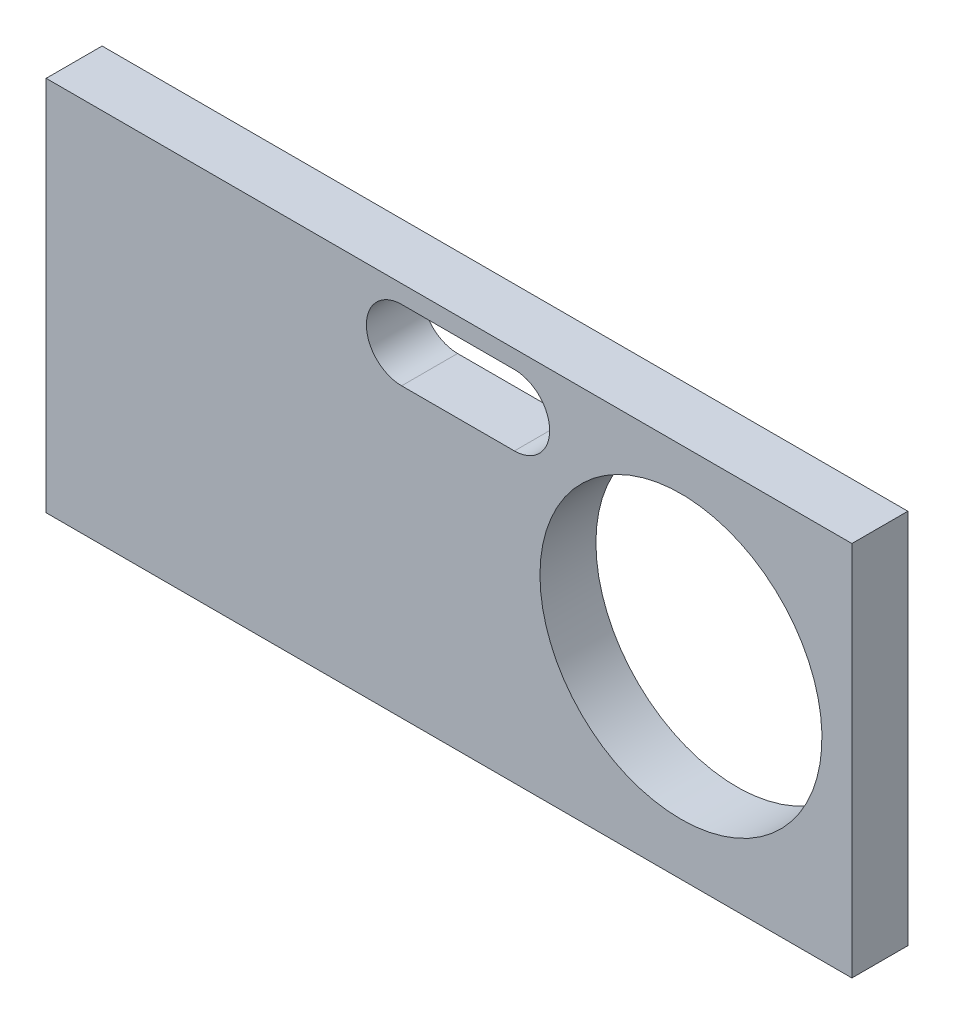
ISO-10303-21;
HEADER;
FILE_DESCRIPTION(('STEP AP214'),'2;1');
FILE_NAME('part.step','',(''),(''),'','','');
FILE_SCHEMA(('AUTOMOTIVE_DESIGN { 1 0 10303 214 1 1 1 1 }'));
ENDSEC;
DATA;
#1=APPLICATION_CONTEXT('core data for automotive mechanical design processes');
#2=APPLICATION_PROTOCOL_DEFINITION('international standard','automotive_design',2000,#1);
#3=PRODUCT_CONTEXT('',#1,'mechanical');
#4=PRODUCT('Part','Part','',(#3));
#5=PRODUCT_RELATED_PRODUCT_CATEGORY('part','',(#4));
#6=PRODUCT_DEFINITION_FORMATION('','',#4);
#7=PRODUCT_DEFINITION_CONTEXT('part definition',#1,'design');
#8=PRODUCT_DEFINITION('design','',#6,#7);
#9=PRODUCT_DEFINITION_SHAPE('','',#8);
#10=(LENGTH_UNIT() NAMED_UNIT(*) SI_UNIT(.MILLI.,.METRE.));
#11=(NAMED_UNIT(*) PLANE_ANGLE_UNIT() SI_UNIT($,.RADIAN.));
#12=(NAMED_UNIT(*) SI_UNIT($,.STERADIAN.) SOLID_ANGLE_UNIT());
#13=UNCERTAINTY_MEASURE_WITH_UNIT(LENGTH_MEASURE(1.E-05),#10,'distance_accuracy_value','');
#14=(GEOMETRIC_REPRESENTATION_CONTEXT(3) GLOBAL_UNCERTAINTY_ASSIGNED_CONTEXT((#13)) GLOBAL_UNIT_ASSIGNED_CONTEXT((#10,
#11,#12)) REPRESENTATION_CONTEXT('',''));
#15=CARTESIAN_POINT('',(0.,0.,0.));
#16=DIRECTION('',(0.,0.,1.));
#17=DIRECTION('',(1.,0.,0.));
#18=AXIS2_PLACEMENT_3D('',#15,#16,#17);
#19=CARTESIAN_POINT('',(22.86,3.175,10.16));
#20=DIRECTION('',(-1.,0.,0.));
#21=DIRECTION('',(0.,0.,1.));
#22=AXIS2_PLACEMENT_3D('',#19,#20,#21);
#23=PLANE('',#22);
#24=DIRECTION('',(0.,-1.,0.));
#25=VECTOR('',#24,1.);
#26=CARTESIAN_POINT('',(22.86,44.958,-6.985));
#27=LINE('',#26,#25);
#28=CARTESIAN_POINT('',(22.86,44.958,-6.985));
#29=VERTEX_POINT('',#28);
#30=CARTESIAN_POINT('',(22.86,23.6076153450278,-6.985));
#31=VERTEX_POINT('',#30);
#32=EDGE_CURVE('E112',#29,#31,#27,.T.);
#33=ORIENTED_EDGE('',*,*,#32,.T.);
#34=DIRECTION('',(0.,0.,1.));
#35=VECTOR('',#34,1.);
#36=CARTESIAN_POINT('',(22.86,23.6076153450278,-6.985));
#37=LINE('',#36,#35);
#38=CARTESIAN_POINT('',(22.86,23.6076153450278,-10.16));
#39=VERTEX_POINT('',#38);
#40=EDGE_CURVE('E99',#39,#31,#37,.T.);
#41=ORIENTED_EDGE('',*,*,#40,.F.);
#42=DIRECTION('',(0.,-1.,0.));
#43=VECTOR('',#42,1.);
#44=CARTESIAN_POINT('',(22.86,3.175,-10.16));
#45=LINE('',#44,#43);
#46=CARTESIAN_POINT('',(22.86,44.958,-10.16));
#47=VERTEX_POINT('',#46);
#48=EDGE_CURVE('E109',#47,#39,#45,.T.);
#49=ORIENTED_EDGE('',*,*,#48,.F.);
#50=DIRECTION('',(0.,0.,1.));
#51=VECTOR('',#50,1.);
#52=CARTESIAN_POINT('',(22.86,44.958,-10.16));
#53=LINE('',#52,#51);
#54=EDGE_CURVE('E165',#47,#29,#53,.T.);
#55=ORIENTED_EDGE('',*,*,#54,.T.);
#56=EDGE_LOOP('',(#33,#41,#49,#55));
#57=FACE_BOUND('',#56,.T.);
#58=ADVANCED_FACE('F32',(#57),#23,.F.);
#59=CARTESIAN_POINT('',(-22.86,3.175,-10.16));
#60=DIRECTION('',(0.,0.,1.));
#61=DIRECTION('',(1.,0.,0.));
#62=AXIS2_PLACEMENT_3D('',#59,#60,#61);
#63=PLANE('',#62);
#64=DIRECTION('',(-1.,0.,0.));
#65=VECTOR('',#64,1.);
#66=CARTESIAN_POINT('',(3.71000000000001,39.933,-10.16));
#67=LINE('',#66,#65);
#68=CARTESIAN_POINT('',(3.71,39.933,-10.16));
#69=VERTEX_POINT('',#68);
#70=CARTESIAN_POINT('',(-2.68999999999999,39.933,-10.16));
#71=VERTEX_POINT('',#70);
#72=EDGE_CURVE('E184',#69,#71,#67,.T.);
#73=ORIENTED_EDGE('',*,*,#72,.F.);
#74=CARTESIAN_POINT('',(3.71000000000001,41.933,-10.16));
#75=DIRECTION('',(0.,0.,-1.));
#76=DIRECTION('',(-1.,0.,0.));
#77=AXIS2_PLACEMENT_3D('',#74,#75,#76);
#78=CIRCLE('',#77,2.);
#79=CARTESIAN_POINT('',(3.71000000000001,43.933,-10.16));
#80=VERTEX_POINT('',#79);
#81=EDGE_CURVE('E46',#80,#69,#78,.T.);
#82=ORIENTED_EDGE('',*,*,#81,.F.);
#83=DIRECTION('',(1.,0.,0.));
#84=VECTOR('',#83,1.);
#85=CARTESIAN_POINT('',(3.71000000000001,43.933,-10.16));
#86=LINE('',#85,#84);
#87=CARTESIAN_POINT('',(-2.68999999999999,43.933,-10.16));
#88=VERTEX_POINT('',#87);
#89=EDGE_CURVE('E157',#88,#80,#86,.T.);
#90=ORIENTED_EDGE('',*,*,#89,.F.);
#91=CARTESIAN_POINT('',(-2.68999999999999,41.933,-10.16));
#92=DIRECTION('',(0.,0.,-1.));
#93=DIRECTION('',(1.,0.,0.));
#94=AXIS2_PLACEMENT_3D('',#91,#92,#93);
#95=CIRCLE('',#94,2.);
#96=EDGE_CURVE('E148',#71,#88,#95,.T.);
#97=ORIENTED_EDGE('',*,*,#96,.F.);
#98=EDGE_LOOP('',(#73,#82,#90,#97));
#99=FACE_BOUND('',#98,.T.);
#100=CARTESIAN_POINT('',(13.16,34.558,-10.16));
#101=DIRECTION('',(0.,0.,-1.));
#102=DIRECTION('',(-1.,0.,0.));
#103=AXIS2_PLACEMENT_3D('',#100,#101,#102);
#104=CIRCLE('',#103,8.);
#105=CARTESIAN_POINT('',(5.16,34.558,-10.16));
#106=VERTEX_POINT('',#105);
#107=EDGE_CURVE('E130',#106,#106,#104,.T.);
#108=ORIENTED_EDGE('',*,*,#107,.F.);
#109=EDGE_LOOP('',(#108));
#110=FACE_BOUND('',#109,.T.);
#111=ORIENTED_EDGE('',*,*,#48,.T.);
#112=DIRECTION('',(-1.,0.,0.));
#113=VECTOR('',#112,1.);
#114=CARTESIAN_POINT('',(-22.86,23.6076153450278,-10.16));
#115=LINE('',#114,#113);
#116=CARTESIAN_POINT('',(-22.86,23.6076153450278,-10.16));
#117=VERTEX_POINT('',#116);
#118=EDGE_CURVE('E96',#39,#117,#115,.T.);
#119=ORIENTED_EDGE('',*,*,#118,.T.);
#120=DIRECTION('',(0.,-1.,0.));
#121=VECTOR('',#120,1.);
#122=CARTESIAN_POINT('',(-22.86,3.175,-10.16));
#123=LINE('',#122,#121);
#124=CARTESIAN_POINT('',(-22.86,44.958,-10.16));
#125=VERTEX_POINT('',#124);
#126=EDGE_CURVE('E119',#125,#117,#123,.T.);
#127=ORIENTED_EDGE('',*,*,#126,.F.);
#128=DIRECTION('',(1.,0.,0.));
#129=VECTOR('',#128,1.);
#130=CARTESIAN_POINT('',(-22.86,44.958,-10.16));
#131=LINE('',#130,#129);
#132=EDGE_CURVE('E116',#125,#47,#131,.T.);
#133=ORIENTED_EDGE('',*,*,#132,.T.);
#134=EDGE_LOOP('',(#111,#119,#127,#133));
#135=FACE_BOUND('',#134,.T.);
#136=ADVANCED_FACE('F114',(#99,#110,#135),#63,.F.);
#137=CARTESIAN_POINT('',(-22.86,3.175,10.16));
#138=DIRECTION('',(1.,0.,0.));
#139=DIRECTION('',(0.,0.,-1.));
#140=AXIS2_PLACEMENT_3D('',#137,#138,#139);
#141=PLANE('',#140);
#142=ORIENTED_EDGE('',*,*,#126,.T.);
#143=DIRECTION('',(0.,0.,1.));
#144=VECTOR('',#143,1.);
#145=CARTESIAN_POINT('',(-22.86,23.6076153450278,-6.985));
#146=LINE('',#145,#144);
#147=CARTESIAN_POINT('',(-22.86,23.6076153450278,-6.98500000000001));
#148=VERTEX_POINT('',#147);
#149=EDGE_CURVE('E102',#117,#148,#146,.T.);
#150=ORIENTED_EDGE('',*,*,#149,.T.);
#151=DIRECTION('',(0.,-1.,0.));
#152=VECTOR('',#151,1.);
#153=CARTESIAN_POINT('',(-22.86,44.958,-6.985));
#154=LINE('',#153,#152);
#155=CARTESIAN_POINT('',(-22.86,44.958,-6.985));
#156=VERTEX_POINT('',#155);
#157=EDGE_CURVE('E169',#156,#148,#154,.T.);
#158=ORIENTED_EDGE('',*,*,#157,.F.);
#159=DIRECTION('',(0.,0.,1.));
#160=VECTOR('',#159,1.);
#161=CARTESIAN_POINT('',(-22.86,44.958,-10.16));
#162=LINE('',#161,#160);
#163=EDGE_CURVE('E166',#125,#156,#162,.T.);
#164=ORIENTED_EDGE('',*,*,#163,.F.);
#165=EDGE_LOOP('',(#142,#150,#158,#164));
#166=FACE_BOUND('',#165,.T.);
#167=ADVANCED_FACE('F180',(#166),#141,.F.);
#168=CARTESIAN_POINT('',(-22.86,44.958,-6.985));
#169=DIRECTION('',(0.,0.,1.));
#170=DIRECTION('',(0.,-1.,0.));
#171=AXIS2_PLACEMENT_3D('',#168,#169,#170);
#172=PLANE('',#171);
#173=DIRECTION('',(1.,0.,0.));
#174=VECTOR('',#173,1.);
#175=CARTESIAN_POINT('',(-22.86,23.6076153450278,-6.985));
#176=LINE('',#175,#174);
#177=EDGE_CURVE('E129',#148,#31,#176,.T.);
#178=ORIENTED_EDGE('',*,*,#177,.T.);
#179=ORIENTED_EDGE('',*,*,#32,.F.);
#180=DIRECTION('',(1.,0.,0.));
#181=VECTOR('',#180,1.);
#182=CARTESIAN_POINT('',(-22.86,44.958,-6.985));
#183=LINE('',#182,#181);
#184=EDGE_CURVE('E123',#156,#29,#183,.T.);
#185=ORIENTED_EDGE('',*,*,#184,.F.);
#186=ORIENTED_EDGE('',*,*,#157,.T.);
#187=EDGE_LOOP('',(#178,#179,#185,#186));
#188=FACE_BOUND('',#187,.T.);
#189=CARTESIAN_POINT('',(3.71000000000001,41.933,-6.985));
#190=DIRECTION('',(0.,0.,1.));
#191=DIRECTION('',(0.,-1.,0.));
#192=AXIS2_PLACEMENT_3D('',#189,#190,#191);
#193=CIRCLE('',#192,2.);
#194=CARTESIAN_POINT('',(3.71000000000001,39.933,-6.985));
#195=VERTEX_POINT('',#194);
#196=CARTESIAN_POINT('',(3.71000000000001,43.933,-6.985));
#197=VERTEX_POINT('',#196);
#198=EDGE_CURVE('E11',#195,#197,#193,.T.);
#199=ORIENTED_EDGE('',*,*,#198,.F.);
#200=DIRECTION('',(1.,0.,0.));
#201=VECTOR('',#200,1.);
#202=CARTESIAN_POINT('',(-22.86,39.933,-6.985));
#203=LINE('',#202,#201);
#204=CARTESIAN_POINT('',(-2.68999999999999,39.933,-6.985));
#205=VERTEX_POINT('',#204);
#206=EDGE_CURVE('E118',#205,#195,#203,.T.);
#207=ORIENTED_EDGE('',*,*,#206,.F.);
#208=CARTESIAN_POINT('',(-2.68999999999999,41.933,-6.985));
#209=DIRECTION('',(0.,0.,1.));
#210=DIRECTION('',(0.,-1.,0.));
#211=AXIS2_PLACEMENT_3D('',#208,#209,#210);
#212=CIRCLE('',#211,2.);
#213=CARTESIAN_POINT('',(-2.68999999999999,43.933,-6.985));
#214=VERTEX_POINT('',#213);
#215=EDGE_CURVE('E121',#214,#205,#212,.T.);
#216=ORIENTED_EDGE('',*,*,#215,.F.);
#217=DIRECTION('',(-1.,0.,0.));
#218=VECTOR('',#217,1.);
#219=CARTESIAN_POINT('',(-22.86,43.933,-6.985));
#220=LINE('',#219,#218);
#221=EDGE_CURVE('E39',#197,#214,#220,.T.);
#222=ORIENTED_EDGE('',*,*,#221,.F.);
#223=EDGE_LOOP('',(#199,#207,#216,#222));
#224=FACE_BOUND('',#223,.T.);
#225=CARTESIAN_POINT('',(13.16,34.558,-6.985));
#226=DIRECTION('',(0.,0.,1.));
#227=DIRECTION('',(0.,-1.,0.));
#228=AXIS2_PLACEMENT_3D('',#225,#226,#227);
#229=CIRCLE('',#228,8.);
#230=CARTESIAN_POINT('',(13.16,26.558,-6.985));
#231=VERTEX_POINT('',#230);
#232=EDGE_CURVE('E127',#231,#231,#229,.T.);
#233=ORIENTED_EDGE('',*,*,#232,.F.);
#234=EDGE_LOOP('',(#233));
#235=FACE_BOUND('',#234,.T.);
#236=ADVANCED_FACE('F151',(#188,#224,#235),#172,.T.);
#237=CARTESIAN_POINT('',(-22.86,44.958,-10.16));
#238=DIRECTION('',(0.,1.,0.));
#239=DIRECTION('',(0.,0.,1.));
#240=AXIS2_PLACEMENT_3D('',#237,#238,#239);
#241=PLANE('',#240);
#242=ORIENTED_EDGE('',*,*,#54,.F.);
#243=ORIENTED_EDGE('',*,*,#132,.F.);
#244=ORIENTED_EDGE('',*,*,#163,.T.);
#245=ORIENTED_EDGE('',*,*,#184,.T.);
#246=EDGE_LOOP('',(#242,#243,#244,#245));
#247=FACE_BOUND('',#246,.T.);
#248=ADVANCED_FACE('F175',(#247),#241,.T.);
#249=CARTESIAN_POINT('',(13.16,34.558,10.16));
#250=DIRECTION('',(0.,0.,-1.));
#251=DIRECTION('',(-1.,0.,0.));
#252=AXIS2_PLACEMENT_3D('',#249,#250,#251);
#253=CYLINDRICAL_SURFACE('',#252,8.);
#254=ORIENTED_EDGE('',*,*,#232,.T.);
#255=EDGE_LOOP('',(#254));
#256=FACE_BOUND('',#255,.T.);
#257=ORIENTED_EDGE('',*,*,#107,.T.);
#258=EDGE_LOOP('',(#257));
#259=FACE_BOUND('',#258,.T.);
#260=ADVANCED_FACE('F192',(#256,#259),#253,.F.);
#261=CARTESIAN_POINT('',(3.71000000000001,41.933,10.16));
#262=DIRECTION('',(0.,0.,-1.));
#263=DIRECTION('',(-1.,0.,0.));
#264=AXIS2_PLACEMENT_3D('',#261,#262,#263);
#265=CYLINDRICAL_SURFACE('',#264,2.);
#266=ORIENTED_EDGE('',*,*,#198,.T.);
#267=DIRECTION('',(0.,0.,-1.));
#268=VECTOR('',#267,1.);
#269=CARTESIAN_POINT('',(3.71000000000001,43.933,10.16));
#270=LINE('',#269,#268);
#271=EDGE_CURVE('E140',#197,#80,#270,.T.);
#272=ORIENTED_EDGE('',*,*,#271,.T.);
#273=ORIENTED_EDGE('',*,*,#81,.T.);
#274=DIRECTION('',(0.,0.,-1.));
#275=VECTOR('',#274,1.);
#276=CARTESIAN_POINT('',(3.71000000000001,39.933,10.16));
#277=LINE('',#276,#275);
#278=EDGE_CURVE('E154',#195,#69,#277,.T.);
#279=ORIENTED_EDGE('',*,*,#278,.F.);
#280=EDGE_LOOP('',(#266,#272,#273,#279));
#281=FACE_BOUND('',#280,.T.);
#282=ADVANCED_FACE('F156',(#281),#265,.F.);
#283=CARTESIAN_POINT('',(3.71000000000001,43.933,10.16));
#284=DIRECTION('',(0.,1.,0.));
#285=DIRECTION('',(0.,0.,1.));
#286=AXIS2_PLACEMENT_3D('',#283,#284,#285);
#287=PLANE('',#286);
#288=ORIENTED_EDGE('',*,*,#221,.T.);
#289=DIRECTION('',(0.,0.,-1.));
#290=VECTOR('',#289,1.);
#291=CARTESIAN_POINT('',(-2.68999999999999,43.933,10.16));
#292=LINE('',#291,#290);
#293=EDGE_CURVE('E138',#214,#88,#292,.T.);
#294=ORIENTED_EDGE('',*,*,#293,.T.);
#295=ORIENTED_EDGE('',*,*,#89,.T.);
#296=ORIENTED_EDGE('',*,*,#271,.F.);
#297=EDGE_LOOP('',(#288,#294,#295,#296));
#298=FACE_BOUND('',#297,.T.);
#299=ADVANCED_FACE('F136',(#298),#287,.F.);
#300=CARTESIAN_POINT('',(-2.68999999999999,41.933,10.16));
#301=DIRECTION('',(0.,0.,-1.));
#302=DIRECTION('',(-1.,0.,0.));
#303=AXIS2_PLACEMENT_3D('',#300,#301,#302);
#304=CYLINDRICAL_SURFACE('',#303,2.);
#305=ORIENTED_EDGE('',*,*,#215,.T.);
#306=DIRECTION('',(0.,0.,-1.));
#307=VECTOR('',#306,1.);
#308=CARTESIAN_POINT('',(-2.68999999999999,39.933,10.16));
#309=LINE('',#308,#307);
#310=EDGE_CURVE('E54',#205,#71,#309,.T.);
#311=ORIENTED_EDGE('',*,*,#310,.T.);
#312=ORIENTED_EDGE('',*,*,#96,.T.);
#313=ORIENTED_EDGE('',*,*,#293,.F.);
#314=EDGE_LOOP('',(#305,#311,#312,#313));
#315=FACE_BOUND('',#314,.T.);
#316=ADVANCED_FACE('F145',(#315),#304,.F.);
#317=CARTESIAN_POINT('',(3.71000000000001,39.933,10.16));
#318=DIRECTION('',(0.,-1.,0.));
#319=DIRECTION('',(0.,0.,-1.));
#320=AXIS2_PLACEMENT_3D('',#317,#318,#319);
#321=PLANE('',#320);
#322=ORIENTED_EDGE('',*,*,#206,.T.);
#323=ORIENTED_EDGE('',*,*,#278,.T.);
#324=ORIENTED_EDGE('',*,*,#72,.T.);
#325=ORIENTED_EDGE('',*,*,#310,.F.);
#326=EDGE_LOOP('',(#322,#323,#324,#325));
#327=FACE_BOUND('',#326,.T.);
#328=ADVANCED_FACE('F153',(#327),#321,.F.);
#329=CARTESIAN_POINT('',(-22.86,23.6076153450278,-6.985));
#330=DIRECTION('',(0.,1.,0.));
#331=DIRECTION('',(0.,0.,1.));
#332=AXIS2_PLACEMENT_3D('',#329,#330,#331);
#333=PLANE('',#332);
#334=ORIENTED_EDGE('',*,*,#40,.T.);
#335=ORIENTED_EDGE('',*,*,#177,.F.);
#336=ORIENTED_EDGE('',*,*,#149,.F.);
#337=ORIENTED_EDGE('',*,*,#118,.F.);
#338=EDGE_LOOP('',(#334,#335,#336,#337));
#339=FACE_BOUND('',#338,.T.);
#340=ADVANCED_FACE('F98',(#339),#333,.F.);
#341=CLOSED_SHELL('',(#58,#136,#167,#236,#248,#260,#282,#299,#316,#328,#340));
#342=MANIFOLD_SOLID_BREP('B2',#341);
#343=ADVANCED_BREP_SHAPE_REPRESENTATION('',(#18,#342),#14);
#344=SHAPE_DEFINITION_REPRESENTATION(#9,#343);
ENDSEC;
END-ISO-10303-21;
